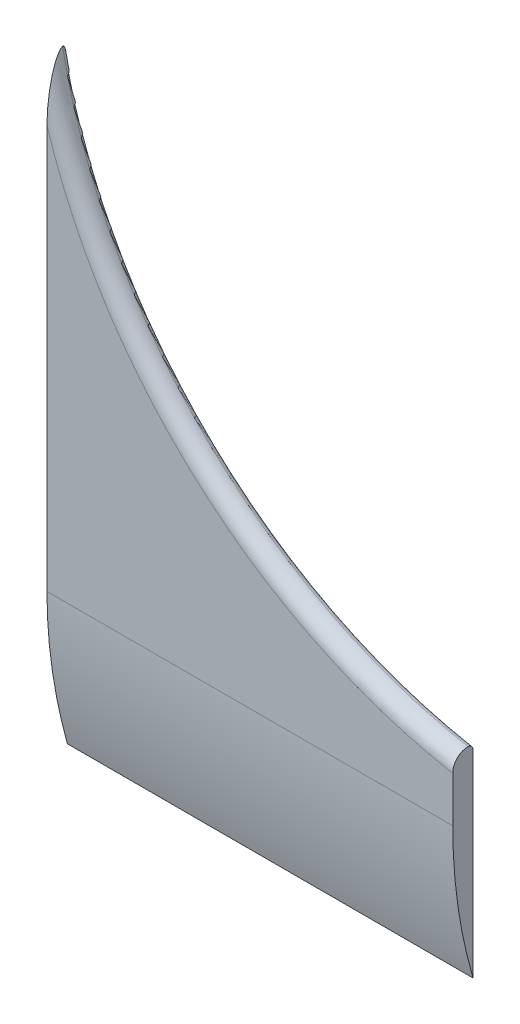
ISO-10303-21;
HEADER;
FILE_DESCRIPTION(('STEP AP214'),'2;1');
FILE_NAME('part.step','',(''),(''),'','','');
FILE_SCHEMA(('AUTOMOTIVE_DESIGN { 1 0 10303 214 1 1 1 1 }'));
ENDSEC;
DATA;
#1=APPLICATION_CONTEXT('core data for automotive mechanical design processes');
#2=APPLICATION_PROTOCOL_DEFINITION('international standard','automotive_design',2000,#1);
#3=PRODUCT_CONTEXT('',#1,'mechanical');
#4=PRODUCT('Part','Part','',(#3));
#5=PRODUCT_RELATED_PRODUCT_CATEGORY('part','',(#4));
#6=PRODUCT_DEFINITION_FORMATION('','',#4);
#7=PRODUCT_DEFINITION_CONTEXT('part definition',#1,'design');
#8=PRODUCT_DEFINITION('design','',#6,#7);
#9=PRODUCT_DEFINITION_SHAPE('','',#8);
#10=(LENGTH_UNIT() NAMED_UNIT(*) SI_UNIT(.MILLI.,.METRE.));
#11=(NAMED_UNIT(*) PLANE_ANGLE_UNIT() SI_UNIT($,.RADIAN.));
#12=(NAMED_UNIT(*) SI_UNIT($,.STERADIAN.) SOLID_ANGLE_UNIT());
#13=UNCERTAINTY_MEASURE_WITH_UNIT(LENGTH_MEASURE(1.E-05),#10,'distance_accuracy_value','');
#14=(GEOMETRIC_REPRESENTATION_CONTEXT(3) GLOBAL_UNCERTAINTY_ASSIGNED_CONTEXT((#13)) GLOBAL_UNIT_ASSIGNED_CONTEXT((#10,
#11,#12)) REPRESENTATION_CONTEXT('',''));
#15=CARTESIAN_POINT('',(0.,0.,0.));
#16=DIRECTION('',(0.,0.,1.));
#17=DIRECTION('',(1.,0.,0.));
#18=AXIS2_PLACEMENT_3D('',#15,#16,#17);
#19=CARTESIAN_POINT('',(40.,-30.,1.));
#20=DIRECTION('',(-1.,0.,0.));
#21=DIRECTION('',(0.,0.,1.));
#22=AXIS2_PLACEMENT_3D('',#19,#20,#21);
#23=PLANE('',#22);
#24=DIRECTION('',(0.,1.,0.));
#25=VECTOR('',#24,1.);
#26=CARTESIAN_POINT('',(40.,-30.,1.));
#27=LINE('',#26,#25);
#28=CARTESIAN_POINT('',(40.,-16.,1.));
#29=VERTEX_POINT('',#28);
#30=CARTESIAN_POINT('',(40.,-11.525023269675,1.));
#31=VERTEX_POINT('',#30);
#32=EDGE_CURVE('E108',#29,#31,#27,.T.);
#33=ORIENTED_EDGE('',*,*,#32,.F.);
#34=CARTESIAN_POINT('',(40.,-16.,-49.));
#35=DIRECTION('',(-1.,0.,0.));
#36=DIRECTION('',(0.,0.,1.));
#37=AXIS2_PLACEMENT_3D('',#34,#35,#36);
#38=CIRCLE('',#37,50.);
#39=CARTESIAN_POINT('',(40.,-30.,-1.));
#40=VERTEX_POINT('',#39);
#41=EDGE_CURVE('E56',#29,#40,#38,.F.);
#42=ORIENTED_EDGE('',*,*,#41,.T.);
#43=DIRECTION('',(0.,1.,0.));
#44=VECTOR('',#43,1.);
#45=CARTESIAN_POINT('',(40.,-30.,-1.));
#46=LINE('',#45,#44);
#47=CARTESIAN_POINT('',(40.,-10.5085104439843,-1.));
#48=VERTEX_POINT('',#47);
#49=EDGE_CURVE('E109',#40,#48,#46,.T.);
#50=ORIENTED_EDGE('',*,*,#49,.T.);
#51=CARTESIAN_POINT('',(40.,-10.5085104439843,-1.));
#52=CARTESIAN_POINT('',(40.,-10.4795471118296,-1.00002221264055));
#53=CARTESIAN_POINT('',(40.,-10.4505882754862,-0.997567320803171));
#54=CARTESIAN_POINT('',(40.,-10.3934931612211,-0.987864810247076));
#55=CARTESIAN_POINT('',(40.,-10.3653566412935,-0.980618616734931));
#56=CARTESIAN_POINT('',(40.,-10.3106840790111,-0.961488695517916));
#57=CARTESIAN_POINT('',(40.,-10.2841490711621,-0.949602006505457));
#58=CARTESIAN_POINT('',(40.,-10.2334790806989,-0.921513841692551));
#59=CARTESIAN_POINT('',(40.,-10.2093433557041,-0.905313706291577));
#60=CARTESIAN_POINT('',(40.,-10.1643591795701,-0.869171944926521));
#61=CARTESIAN_POINT('',(40.,-10.1434870866289,-0.849259761850499));
#62=CARTESIAN_POINT('',(40.,-10.1054437793418,-0.806157591512101));
#63=CARTESIAN_POINT('',(40.,-10.088273148239,-0.782967088633384));
#64=CARTESIAN_POINT('',(40.,-10.0584193230411,-0.734366834916657));
#65=CARTESIAN_POINT('',(40.,-10.0456694067947,-0.708998017663969));
#66=CARTESIAN_POINT('',(40.,-10.0246931559389,-0.656464460146384));
#67=CARTESIAN_POINT('',(40.,-10.016463059806,-0.629301234397732));
#68=CARTESIAN_POINT('',(40.,-10.0070913179838,-0.584941540157593));
#69=CARTESIAN_POINT('',(40.,-10.0044336041097,-0.568050899541574));
#70=CARTESIAN_POINT('',(40.,-10.0008884178412,-0.534109481418608));
#71=CARTESIAN_POINT('',(40.,-9.99999840453974,-0.517058969209915));
#72=CARTESIAN_POINT('',(40.,-9.99999999999902,-0.500000000000208));
#73=B_SPLINE_CURVE_WITH_KNOTS('',3,(#51,#52,#53,#54,#55,#56,#57,#58,#59,#60,#61,#62,#63,#64,#65,
#66,#67,#68,#69,#70,#71,#72),.UNSPECIFIED.,.F.,.F.,(4,2,2,2,2,2,2,2,2,2,4),(0.,
0.0867802611777171,0.173534720558421,0.26034463257154,0.347127599904836,0.433249453384843,
0.519384867269449,0.604157002318121,0.688858480247292,0.740069336086513,0.791206527603931),.UNSPECIFIED.);
#74=CARTESIAN_POINT('',(40.,-10.,-0.5));
#75=VERTEX_POINT('',#74);
#76=EDGE_CURVE('E111',#48,#75,#73,.T.);
#77=ORIENTED_EDGE('',*,*,#76,.T.);
#78=CARTESIAN_POINT('',(40.,-10.,-0.5));
#79=CARTESIAN_POINT('',(40.,-9.99999989012411,-0.458310910647502));
#80=CARTESIAN_POINT('',(40.,-10.0017690069438,-0.416641982005305));
#81=CARTESIAN_POINT('',(40.,-10.0088241022484,-0.333606404976778));
#82=CARTESIAN_POINT('',(40.,-10.0141097896887,-0.29223973186107));
#83=CARTESIAN_POINT('',(40.,-10.0351798469738,-0.1691503860436));
#84=CARTESIAN_POINT('',(40.,-10.0561774253668,-0.0882588576881697));
#85=CARTESIAN_POINT('',(40.,-10.1114326494251,0.0688379045900222));
#86=CARTESIAN_POINT('',(40.,-10.1456944090945,0.14504167605668));
#87=CARTESIAN_POINT('',(40.,-10.2264313436635,0.29068002040499));
#88=CARTESIAN_POINT('',(40.,-10.2729060571775,0.360114848870493));
#89=CARTESIAN_POINT('',(40.,-10.3770788360443,0.490830210576606));
#90=CARTESIAN_POINT('',(40.,-10.4348584708774,0.552045673429615));
#91=CARTESIAN_POINT('',(40.,-10.5597421412859,0.664103914660427));
#92=CARTESIAN_POINT('',(40.,-10.626848275126,0.714944352506364));
#93=CARTESIAN_POINT('',(40.,-10.7696163390778,0.805662485032933));
#94=CARTESIAN_POINT('',(40.,-10.845398430101,0.845350880953757));
#95=CARTESIAN_POINT('',(40.,-11.0024735135336,0.911635714338112));
#96=CARTESIAN_POINT('',(40.,-11.0837644862225,0.938236920726725));
#97=CARTESIAN_POINT('',(40.,-11.2253380884245,0.971929604679482));
#98=CARTESIAN_POINT('',(40.,-11.2848292202642,0.98244900637073));
#99=CARTESIAN_POINT('',(40.,-11.404547480364,0.996484026174966));
#100=CARTESIAN_POINT('',(40.,-11.4647734631565,1.0000094171417));
#101=CARTESIAN_POINT('',(40.,-11.525023269675,1.));
#102=B_SPLINE_CURVE_WITH_KNOTS('',3,(#78,#79,#80,#81,#82,#83,#84,#85,#86,#87,#88,#89,#90,#91,
#92,#93,#94,#95,#96,#97,#98,#99,#100,#101),.UNSPECIFIED.,.F.,.F.,(4,2,2,2,2,2,2,2,2,2,2,4),(0.,
0.12498980418253,0.249969265028521,0.499396510582564,0.748901180278982,0.998396425448825,
1.24976308747336,1.50118639349452,1.75665003598389,2.0120205193579,2.19287360343205,
2.37347379983082),.UNSPECIFIED.);
#103=EDGE_CURVE('E133',#75,#31,#102,.T.);
#104=ORIENTED_EDGE('',*,*,#103,.T.);
#105=EDGE_LOOP('',(#33,#42,#50,#77,#104));
#106=FACE_BOUND('',#105,.T.);
#107=ADVANCED_FACE('F43',(#106),#23,.F.);
#108=CARTESIAN_POINT('',(49.1547594742265,39.1547594742265,1.));
#109=DIRECTION('',(0.,0.,1.));
#110=DIRECTION('',(1.,0.,0.));
#111=AXIS2_PLACEMENT_3D('',#108,#109,#110);
#112=PLANE('',#111);
#113=DIRECTION('',(0.,-1.,0.));
#114=VECTOR('',#113,1.);
#115=CARTESIAN_POINT('',(0.,0.,1.));
#116=LINE('',#115,#114);
#117=CARTESIAN_POINT('',(0.,23.7905276017592,1.));
#118=VERTEX_POINT('',#117);
#119=CARTESIAN_POINT('',(0.,-16.,1.));
#120=VERTEX_POINT('',#119);
#121=EDGE_CURVE('E97',#118,#120,#116,.T.);
#122=ORIENTED_EDGE('',*,*,#121,.T.);
#123=DIRECTION('',(-1.,0.,0.));
#124=VECTOR('',#123,1.);
#125=CARTESIAN_POINT('',(40.,-16.,1.));
#126=LINE('',#125,#124);
#127=EDGE_CURVE('E104',#120,#29,#126,.F.);
#128=ORIENTED_EDGE('',*,*,#127,.T.);
#129=ORIENTED_EDGE('',*,*,#32,.T.);
#130=CARTESIAN_POINT('',(49.1547594742265,39.1547594742265,1.));
#131=DIRECTION('',(0.,0.,1.));
#132=DIRECTION('',(1.,0.,0.));
#133=AXIS2_PLACEMENT_3D('',#130,#131,#132);
#134=CIRCLE('',#133,51.5);
#135=EDGE_CURVE('E107',#31,#118,#134,.F.);
#136=ORIENTED_EDGE('',*,*,#135,.T.);
#137=EDGE_LOOP('',(#122,#128,#129,#136));
#138=FACE_BOUND('',#137,.T.);
#139=ADVANCED_FACE('F103',(#138),#112,.T.);
#140=CARTESIAN_POINT('',(49.1547594742265,39.1547594742265,-1.));
#141=DIRECTION('',(0.,0.,1.));
#142=DIRECTION('',(1.,0.,0.));
#143=AXIS2_PLACEMENT_3D('',#140,#141,#142);
#144=PLANE('',#143);
#145=DIRECTION('',(0.,-1.,0.));
#146=VECTOR('',#145,1.);
#147=CARTESIAN_POINT('',(0.,0.,-1.));
#148=LINE('',#147,#146);
#149=CARTESIAN_POINT('',(0.,27.576347621518,-1.));
#150=VERTEX_POINT('',#149);
#151=CARTESIAN_POINT('',(0.,-30.,-1.));
#152=VERTEX_POINT('',#151);
#153=EDGE_CURVE('E99',#150,#152,#148,.T.);
#154=ORIENTED_EDGE('',*,*,#153,.F.);
#155=CARTESIAN_POINT('',(49.1547594742265,39.1547594742265,-1.));
#156=DIRECTION('',(0.,0.,1.));
#157=DIRECTION('',(1.,0.,0.));
#158=AXIS2_PLACEMENT_3D('',#155,#156,#157);
#159=CIRCLE('',#158,50.5);
#160=EDGE_CURVE('E70',#150,#48,#159,.T.);
#161=ORIENTED_EDGE('',*,*,#160,.T.);
#162=ORIENTED_EDGE('',*,*,#49,.F.);
#163=DIRECTION('',(1.,0.,0.));
#164=VECTOR('',#163,1.);
#165=CARTESIAN_POINT('',(0.,-30.,-1.));
#166=LINE('',#165,#164);
#167=EDGE_CURVE('E143',#152,#40,#166,.T.);
#168=ORIENTED_EDGE('',*,*,#167,.F.);
#169=EDGE_LOOP('',(#154,#161,#162,#168));
#170=FACE_BOUND('',#169,.T.);
#171=ADVANCED_FACE('F128',(#170),#144,.F.);
#172=CARTESIAN_POINT('',(49.1547594742265,39.1547594742265,-0.5));
#173=DIRECTION('',(0.,0.,1.));
#174=DIRECTION('',(1.,0.,0.));
#175=AXIS2_PLACEMENT_3D('',#172,#173,#174);
#176=TOROIDAL_SURFACE('',#175,51.5,1.5);
#177=CARTESIAN_POINT('',(0.017990406996677,19.3723488315098,-0.801044172473317));
#178=CARTESIAN_POINT('',(0.0201890210205972,19.3518732019691,-0.773692358620135));
#179=CARTESIAN_POINT('',(0.0223792775670738,19.3328778936785,-0.745020922448024));
#180=CARTESIAN_POINT('',(0.0266823967686508,19.2989926408342,-0.685001106760244));
#181=CARTESIAN_POINT('',(0.0287943117257762,19.2841439654705,-0.653629620025882));
#182=CARTESIAN_POINT('',(0.0325311046193656,19.2619447971403,-0.593584510019055));
#183=CARTESIAN_POINT('',(0.0341814862719751,19.2538029741086,-0.565213608501333));
#184=CARTESIAN_POINT('',(0.0372760641839536,19.2424523600466,-0.507595439493937));
#185=CARTESIAN_POINT('',(0.0387211333625778,19.2392220807779,-0.47835256350332));
#186=CARTESIAN_POINT('',(0.0413608576301072,19.2380254930203,-0.419625099429942));
#187=CARTESIAN_POINT('',(0.0425545040747453,19.2400799662378,-0.390140012974413));
#188=CARTESIAN_POINT('',(0.0446575849355582,19.2492989336148,-0.331938062588085));
#189=CARTESIAN_POINT('',(0.0455664812588236,19.2564730194961,-0.303222745774203));
#190=CARTESIAN_POINT('',(0.0472905879379253,19.277490095731,-0.240613521425196));
#191=CARTESIAN_POINT('',(0.0480316376553601,19.2925162582786,-0.207119794316093));
#192=CARTESIAN_POINT('',(0.0491551960677224,19.3277136078244,-0.142976752530948));
#193=CARTESIAN_POINT('',(0.0495370694893166,19.3478938309533,-0.112332563730914));
#194=CARTESIAN_POINT('',(0.050181169024065,19.4062043891758,-0.0349352116313078));
#195=CARTESIAN_POINT('',(0.0502059778865656,19.4474988306486,0.00940677811335384));
#196=CARTESIAN_POINT('',(0.0497894707158123,19.5359357167304,0.0917479943867213));
#197=CARTESIAN_POINT('',(0.0493467786088654,19.5830950630713,0.129728112697079));
#198=CARTESIAN_POINT('',(0.0479866192530714,19.6968128249044,0.212090447634693));
#199=CARTESIAN_POINT('',(0.0469620458030121,19.7647205934824,0.254583921059492));
#200=CARTESIAN_POINT('',(0.0446548341515669,19.9042566912021,0.333038844629393));
#201=CARTESIAN_POINT('',(0.0433716986276272,19.9758919899055,0.368987448672048));
#202=CARTESIAN_POINT('',(0.0406762663358588,20.1218484686142,0.435915757261977));
#203=CARTESIAN_POINT('',(0.039263361017678,20.1961811993873,0.466869955558987));
#204=CARTESIAN_POINT('',(0.0363988543183283,20.3463634892609,0.524571968888383));
#205=CARTESIAN_POINT('',(0.0349472873485611,20.4222116854011,0.551323387382656));
#206=CARTESIAN_POINT('',(0.0312771826923507,20.6163702649632,0.614912227354919));
#207=CARTESIAN_POINT('',(0.029068517823946,20.7354554404681,0.649377532449211));
#208=CARTESIAN_POINT('',(0.0248048147947278,20.9753294132509,0.711859436716994));
#209=CARTESIAN_POINT('',(0.0227498522202477,21.0961190144591,0.739872876947634));
#210=CARTESIAN_POINT('',(0.0188572750381736,21.3390206898577,0.79059309534918));
#211=CARTESIAN_POINT('',(0.0170200458293505,21.4611347034311,0.81329053124272));
#212=CARTESIAN_POINT('',(0.0136058339349642,21.706137626248,0.854092879137539));
#213=CARTESIAN_POINT('',(0.012028890963026,21.829026650776,0.872197090545524));
#214=CARTESIAN_POINT('',(0.00772305582729158,22.1986027385869,0.920506936267189));
#215=CARTESIAN_POINT('',(0.00542093689504891,22.4460903711893,0.94468835490887));
#216=CARTESIAN_POINT('',(0.00201382412319227,22.9417018746131,0.979901218347977));
#217=CARTESIAN_POINT('',(0.00090767485700025,23.1898248988072,0.99094535611118));
#218=CARTESIAN_POINT('',(-7.13499441072461E-05,23.6464208130772,1.00071654819759));
#219=CARTESIAN_POINT('',(-0.000113794251979718,23.8548602297423,1.00113722345796));
#220=CARTESIAN_POINT('',(0.000552315685551214,24.2716544119936,0.994494728350912));
#221=CARTESIAN_POINT('',(0.00126101491139938,24.4800091534702,0.987430113225443));
#222=CARTESIAN_POINT('',(0.00334748288730052,24.8959345632528,0.966172421404106));
#223=CARTESIAN_POINT('',(0.00472391869669669,25.1035059668465,0.951993544325087));
#224=CARTESIAN_POINT('',(0.00804399005413374,25.5180163329282,0.916610382166509));
#225=CARTESIAN_POINT('',(0.00998756190793681,25.7249553638013,0.895406885975699));
#226=CARTESIAN_POINT('',(0.0147880426709352,26.182481815837,0.840497799850541));
#227=CARTESIAN_POINT('',(0.0177515103200017,26.432868427986,0.805082945559892));
#228=CARTESIAN_POINT('',(0.0224831681876911,26.8070170256541,0.743305188998795));
#229=CARTESIAN_POINT('',(0.0241082890902726,26.9315057917562,0.721267655377457));
#230=CARTESIAN_POINT('',(0.0274097183053882,27.1798872114429,0.674065670845711));
#231=CARTESIAN_POINT('',(0.0290860244263493,27.3037798902878,0.648901353672092));
#232=CARTESIAN_POINT('',(0.0328330244826292,27.5798899833358,0.588782144992187));
#233=CARTESIAN_POINT('',(0.0349036810491829,27.7319107554242,0.552916918088591));
#234=CARTESIAN_POINT('',(0.0389195173263716,28.0343672777805,0.474907948010176));
#235=CARTESIAN_POINT('',(0.0408646962996604,28.18480301873,0.432764167945399));
#236=CARTESIAN_POINT('',(0.04378896715468,28.4290068569604,0.357142673856988));
#237=CARTESIAN_POINT('',(0.0448624008570281,28.5235185954956,0.326074068399809));
#238=CARTESIAN_POINT('',(0.0468039875198912,28.7110531776099,0.259861990099433));
#239=CARTESIAN_POINT('',(0.047672294868651,28.8040770915176,0.224721611757512));
#240=CARTESIAN_POINT('',(0.0488460997610177,28.9566992294885,0.161892403718618));
#241=CARTESIAN_POINT('',(0.0492425878923735,29.0169212778684,0.13572529675186));
#242=CARTESIAN_POINT('',(0.0498411880162019,29.1361103923384,0.0803717767957806));
#243=CARTESIAN_POINT('',(0.0500429680553036,29.1950751481714,0.0511803010984012));
#244=CARTESIAN_POINT('',(0.050172636218612,29.3150964940404,-0.0133427933031501));
#245=CARTESIAN_POINT('',(0.0500797442643694,29.3759977305432,-0.0489652620555763));
#246=CARTESIAN_POINT('',(0.0494019134964185,29.4936247583052,-0.126486236789947));
#247=CARTESIAN_POINT('',(0.0488187597717216,29.5503648867774,-0.168361521403146));
#248=CARTESIAN_POINT('',(0.0473945697745619,29.6246141142479,-0.234476444117406));
#249=CARTESIAN_POINT('',(0.0469037930713385,29.6456604272482,-0.254707885757142));
#250=CARTESIAN_POINT('',(0.0457290179360025,29.6856361856867,-0.297270236574779));
#251=CARTESIAN_POINT('',(0.0450446631148599,29.7045616359112,-0.319604966961981));
#252=CARTESIAN_POINT('',(0.0434161046249437,29.7394855479511,-0.367039587665138));
#253=CARTESIAN_POINT('',(0.0424680854194472,29.7554347958519,-0.392176557026415));
#254=CARTESIAN_POINT('',(0.040253886356786,29.7822770511771,-0.444999805102793));
#255=CARTESIAN_POINT('',(0.0389892561364588,29.7931939704242,-0.472673262661758));
#256=CARTESIAN_POINT('',(0.0366331741715174,29.8053619830407,-0.519621763692003));
#257=CARTESIAN_POINT('',(0.0356412085252932,29.8086727713579,-0.538365985320766));
#258=CARTESIAN_POINT('',(0.0335333414746627,29.8120292431953,-0.576130563115314));
#259=CARTESIAN_POINT('',(0.0324175816890461,29.8120786199241,-0.595150582545253));
#260=CARTESIAN_POINT('',(0.0300973748896293,29.8088913042832,-0.632867341476952));
#261=CARTESIAN_POINT('',(0.02889307550422,29.8056599717673,-0.651564557684276));
#262=CARTESIAN_POINT('',(0.026431071837085,29.7962450566803,-0.688236167354146));
#263=CARTESIAN_POINT('',(0.0251732268972886,29.7900531975361,-0.706208380281744));
#264=CARTESIAN_POINT('',(0.0229209848602783,29.776882545761,-0.737251315253963));
#265=CARTESIAN_POINT('',(0.0219295666177269,29.7703772625689,-0.750529912009869));
#266=CARTESIAN_POINT('',(0.019953896877257,29.7561916504333,-0.776331246492334));
#267=CARTESIAN_POINT('',(0.0189696420350598,29.7485195208591,-0.788858468201027));
#268=CARTESIAN_POINT('',(0.0179904069966788,29.7403648976845,-0.801044172473273));
#269=B_SPLINE_CURVE_WITH_KNOTS('',3,(#177,#178,#179,#180,#181,#182,#183,#184,#185,#186,#187,
#188,#189,#190,#191,#192,#193,#194,#195,#196,#197,#198,#199,#200,#201,#202,#203,#204,#205,#206,
#207,#208,#209,#210,#211,#212,#213,#214,#215,#216,#217,#218,#219,#220,#221,#222,#223,#224,#225,
#226,#227,#228,#229,#230,#231,#232,#233,#234,#235,#236,#237,#238,#239,#240,#241,#242,#243,#244,
#245,#246,#247,#248,#249,#250,#251,#252,#253,#254,#255,#256,#257,#258,#259,#260,#261,#262,#263,
#264,#265,#266,#267,#268),.UNSPECIFIED.,.F.,.F.,(4,2,2,2,2,2,2,2,2,2,2,2,2,2,2,2,2,2,2,2,2,2,2,
2,2,2,2,2,2,2,2,2,2,2,2,2,2,2,2,2,2,2,2,2,2,4),(0.,0.102922209561116,0.20683493780899,
0.295136902624843,0.383051419102899,0.471312177762052,0.559738730746496,0.6692745429935,
0.779003728377098,0.959754471176885,1.14103873466118,1.3808197230488,1.62106638956318,
1.86250360202711,2.10373266306707,2.475454008559,2.84735697006074,3.21990868549464,
3.59251719121429,4.33806516973589,5.08289222880438,5.70807018898893,6.3333688386068,
6.95742436699771,7.58140983556232,8.33981944811535,8.71909241166976,9.09834915878347,
9.56687030197129,10.0353941980875,10.3338087427513,10.6319979651382,10.8289295124438,
11.0261962137332,11.2376751245937,11.4483873392101,11.5358713503869,11.6235174851147,
11.7125046240375,11.8010644551975,11.8579920543433,11.9148551878141,11.9716255704801,
12.0285555991461,12.072949707255,12.1170451601603),.UNSPECIFIED.);
#270=CARTESIAN_POINT('',(0.0376178066529316,29.8002742180775,-0.499999999999127));
#271=VERTEX_POINT('',#270);
#272=EDGE_CURVE('E146',#118,#271,#269,.T.);
#273=ORIENTED_EDGE('',*,*,#272,.F.);
#274=ORIENTED_EDGE('',*,*,#135,.F.);
#275=ORIENTED_EDGE('',*,*,#103,.F.);
#276=CARTESIAN_POINT('',(49.1547594742265,39.1547594742265,-0.5));
#277=DIRECTION('',(0.,0.,1.));
#278=DIRECTION('',(1.,0.,0.));
#279=AXIS2_PLACEMENT_3D('',#276,#277,#278);
#280=CIRCLE('',#279,50.);
#281=EDGE_CURVE('E139',#271,#75,#280,.T.);
#282=ORIENTED_EDGE('',*,*,#281,.F.);
#283=EDGE_LOOP('',(#273,#274,#275,#282));
#284=FACE_BOUND('',#283,.T.);
#285=ADVANCED_FACE('F130',(#284),#176,.T.);
#286=CARTESIAN_POINT('',(49.1547594742265,39.1547594742265,-0.5));
#287=DIRECTION('',(0.,0.,1.));
#288=DIRECTION('',(1.,0.,0.));
#289=AXIS2_PLACEMENT_3D('',#286,#287,#288);
#290=TOROIDAL_SURFACE('',#289,50.5,0.5);
#291=CARTESIAN_POINT('',(0.0453770950277599,29.5580049950777,-0.308136543672596));
#292=CARTESIAN_POINT('',(0.045198757860582,29.5714162059146,-0.313915006838382));
#293=CARTESIAN_POINT('',(0.0450093352750231,29.5847436834,-0.31990285510491));
#294=CARTESIAN_POINT('',(0.0446003255279736,29.6111938367429,-0.332439576185241));
#295=CARTESIAN_POINT('',(0.0443806243177517,29.6243155188169,-0.33899053315289));
#296=CARTESIAN_POINT('',(0.0438919415707149,29.6508851651342,-0.353110839141263));
#297=CARTESIAN_POINT('',(0.0436209906179522,29.6643145792057,-0.360715442375553));
#298=CARTESIAN_POINT('',(0.0430251378076047,29.6905773091371,-0.376861724855844));
#299=CARTESIAN_POINT('',(0.0427003309538173,29.7034116246399,-0.385401745143881));
#300=CARTESIAN_POINT('',(0.0419802717203205,29.7280060024566,-0.403638025998714));
#301=CARTESIAN_POINT('',(0.041585897023586,29.7397769657512,-0.413319432963658));
#302=CARTESIAN_POINT('',(0.0406957618898348,29.7616169093502,-0.434301389513328));
#303=CARTESIAN_POINT('',(0.0402013621944743,29.7717057262487,-0.445579654835706));
#304=CARTESIAN_POINT('',(0.0393892301382069,29.7839270332549,-0.463293502579613));
#305=CARTESIAN_POINT('',(0.0391303995365055,29.7873261541827,-0.468846397232819));
#306=CARTESIAN_POINT('',(0.0385825963985847,29.7933298455641,-0.480375654997578));
#307=CARTESIAN_POINT('',(0.038293622352893,29.7959343762019,-0.486352039311117));
#308=CARTESIAN_POINT('',(0.0376827129018707,29.8001314034163,-0.498740664004856));
#309=CARTESIAN_POINT('',(0.0373604220845758,29.8017113190524,-0.505157290767459));
#310=CARTESIAN_POINT('',(0.0366935316519879,29.8035873254423,-0.518173480381845));
#311=CARTESIAN_POINT('',(0.0363489648854589,29.8038852646993,-0.524772766016514));
#312=CARTESIAN_POINT('',(0.0356917455895001,29.8031921990633,-0.537124879286454));
#313=CARTESIAN_POINT('',(0.0353800607560878,29.8023475430412,-0.5428866211971));
#314=CARTESIAN_POINT('',(0.0347590794878132,29.799715603882,-0.554190388632589));
#315=CARTESIAN_POINT('',(0.0344497857014135,29.7979273951188,-0.559732192648047));
#316=CARTESIAN_POINT('',(0.0337198300873809,29.7927088799618,-0.572628643772737));
#317=CARTESIAN_POINT('',(0.0333035724362805,29.7889087163878,-0.579832061731898));
#318=CARTESIAN_POINT('',(0.0324966357931523,29.780240053657,-0.593562633824448));
#319=CARTESIAN_POINT('',(0.0321060268750929,29.7753687739745,-0.600087961542021));
#320=CARTESIAN_POINT('',(0.031028307291341,29.7604438384837,-0.617831801115321));
#321=CARTESIAN_POINT('',(0.0303725614177007,29.7495145966686,-0.62830448947257));
#322=CARTESIAN_POINT('',(0.029131861739377,29.7263784985852,-0.647710039208257));
#323=CARTESIAN_POINT('',(0.0285471464172816,29.7141675816931,-0.656637753782547));
#324=CARTESIAN_POINT('',(0.0270555401713048,29.6805253479182,-0.67902051891289));
#325=CARTESIAN_POINT('',(0.0261973128893771,29.6584295269498,-0.691468321260484));
#326=CARTESIAN_POINT('',(0.0245815848749305,29.6132191739575,-0.714393291906678));
#327=CARTESIAN_POINT('',(0.0238243467719916,29.5901021862068,-0.724865350348392));
#328=CARTESIAN_POINT('',(0.0223815744323368,29.5431541576988,-0.744451692059881));
#329=CARTESIAN_POINT('',(0.0216964517258429,29.5193199220983,-0.753558296583493));
#330=CARTESIAN_POINT('',(0.020387163131368,29.471305038017,-0.770686515842333));
#331=CARTESIAN_POINT('',(0.0197629194903482,29.447124877856,-0.778709519702449));
#332=CARTESIAN_POINT('',(0.0178031261114553,29.3677183142373,-0.803560235075192));
#333=CARTESIAN_POINT('',(0.0165679083919984,29.311953904067,-0.818671349508412));
#334=CARTESIAN_POINT('',(0.0142775040174764,29.1997263320598,-0.846085881914929));
#335=CARTESIAN_POINT('',(0.0132224417981293,29.1432627159129,-0.858387361201193));
#336=CARTESIAN_POINT('',(0.0112582766795978,29.029787391855,-0.880888465943623));
#337=CARTESIAN_POINT('',(0.0103495044005211,28.9727747427151,-0.891083344750723));
#338=CARTESIAN_POINT('',(0.00866158444231688,28.85846411667,-0.909751683890864));
#339=CARTESIAN_POINT('',(0.007882453645075,28.8011661036037,-0.918224920063692));
#340=CARTESIAN_POINT('',(0.00572178663580306,28.6289937949697,-0.941462845461128));
#341=CARTESIAN_POINT('',(0.00451664155775369,28.5138212923474,-0.954049477489964));
#342=CARTESIAN_POINT('',(0.00253327214575766,28.2832220888156,-0.97451664503094));
#343=CARTESIAN_POINT('',(0.00175450453603676,28.1677959004142,-0.982403170400428));
#344=CARTESIAN_POINT('',(0.000610784924985685,27.9368775831105,-0.99392096113107));
#345=CARTESIAN_POINT('',(0.000245305695861183,27.8213857266914,-0.997557648166352));
#346=CARTESIAN_POINT('',(-6.88990842819854E-05,27.5902947892979,-1.00068635800719));
#347=CARTESIAN_POINT('',(-1.74405933308231E-05,27.4746956834961,-1.00017655049337));
#348=CARTESIAN_POINT('',(0.000519975125807166,27.2438279197943,-0.994816963470269));
#349=CARTESIAN_POINT('',(0.00100504977040029,27.1285590675659,-0.989975999592087));
#350=CARTESIAN_POINT('',(0.00243993736783401,26.8983654654847,-0.975444923627007));
#351=CARTESIAN_POINT('',(0.00338959139225161,26.7834406114706,-0.965756469797015));
#352=CARTESIAN_POINT('',(0.00581609477571328,26.5530886303115,-0.940426575915915));
#353=CARTESIAN_POINT('',(0.00729793676009335,26.4376673368425,-0.92472866400162));
#354=CARTESIAN_POINT('',(0.00998847548149581,26.26553794402,-0.895111801844585));
#355=CARTESIAN_POINT('',(0.0109637952619336,26.2083046086849,-0.884221964963178));
#356=CARTESIAN_POINT('',(0.0130919357225178,26.0943816141485,-0.859915447937838));
#357=CARTESIAN_POINT('',(0.0142447059485061,26.0376918052592,-0.846499485801185));
#358=CARTESIAN_POINT('',(0.0166676579829161,25.9293732735077,-0.817456443532671));
#359=CARTESIAN_POINT('',(0.0179228068810334,25.8776808327187,-0.802066916464355));
#360=CARTESIAN_POINT('',(0.0206548880259423,25.7757202364614,-0.76737209809092));
#361=CARTESIAN_POINT('',(0.0221311276649952,25.7254481961002,-0.74807897153531));
#362=CARTESIAN_POINT('',(0.0244307629681132,25.6566817248135,-0.716462026637264));
#363=CARTESIAN_POINT('',(0.0251237049829415,25.636982556909,-0.706767667709233));
#364=CARTESIAN_POINT('',(0.0265731806408769,25.5983333245388,-0.686005594566582));
#365=CARTESIAN_POINT('',(0.0273296449904451,25.5793824761209,-0.674939370734467));
#366=CARTESIAN_POINT('',(0.0289324164994078,25.5424006331982,-0.650818095994432));
#367=CARTESIAN_POINT('',(0.0297798397837599,25.5243863706062,-0.637737209210404));
#368=CARTESIAN_POINT('',(0.0315756965429349,25.4905737636379,-0.608984879946191));
#369=CARTESIAN_POINT('',(0.0325234156398562,25.4747613888476,-0.593331370776094));
#370=CARTESIAN_POINT('',(0.03392620468829,25.4558329856756,-0.569010169863404));
#371=CARTESIAN_POINT('',(0.0343329621383112,25.4508182433722,-0.561836062398699));
#372=CARTESIAN_POINT('',(0.0351630203395233,25.4417598883023,-0.546886233151399));
#373=CARTESIAN_POINT('',(0.0355863218079144,25.4377163176916,-0.539110485272724));
#374=CARTESIAN_POINT('',(0.036448624107023,25.4308805994373,-0.522895315742291));
#375=CARTESIAN_POINT('',(0.0368877558394556,25.4281049409065,-0.514448738928631));
#376=CARTESIAN_POINT('',(0.0377622903412389,25.4242339287039,-0.497180169052539));
#377=CARTESIAN_POINT('',(0.0381976987035869,25.4231353161742,-0.488358938413324));
#378=CARTESIAN_POINT('',(0.0390015872382954,25.4228082172126,-0.471614143294396));
#379=CARTESIAN_POINT('',(0.0393722823915806,25.4233946774433,-0.46369404746067));
#380=CARTESIAN_POINT('',(0.0400842805905182,25.425978770817,-0.44809286642429));
#381=CARTESIAN_POINT('',(0.0404255821366811,25.4279764759057,-0.440411793427931));
#382=CARTESIAN_POINT('',(0.0411477270534538,25.4337706762144,-0.423748002019019));
#383=CARTESIAN_POINT('',(0.0415195096946664,25.4378759640523,-0.414874144213157));
#384=CARTESIAN_POINT('',(0.0422122460650746,25.447467029817,-0.397841793726185));
#385=CARTESIAN_POINT('',(0.0425327891872361,25.4529631284326,-0.389689293032224));
#386=CARTESIAN_POINT('',(0.0433938422267677,25.4702342947347,-0.367167369862703));
#387=CARTESIAN_POINT('',(0.0438746333499734,25.4832282769052,-0.35376004059694));
#388=CARTESIAN_POINT('',(0.0447052612762184,25.5107243766272,-0.329408430100528));
#389=CARTESIAN_POINT('',(0.0450584769101184,25.5251721480237,-0.318404233246212));
#390=CARTESIAN_POINT('',(0.045377095027759,25.5398483484615,-0.30813654367262));
#391=B_SPLINE_CURVE_WITH_KNOTS('',3,(#291,#292,#293,#294,#295,#296,#297,#298,#299,#300,#301,
#302,#303,#304,#305,#306,#307,#308,#309,#310,#311,#312,#313,#314,#315,#316,#317,#318,#319,#320,
#321,#322,#323,#324,#325,#326,#327,#328,#329,#330,#331,#332,#333,#334,#335,#336,#337,#338,#339,
#340,#341,#342,#343,#344,#345,#346,#347,#348,#349,#350,#351,#352,#353,#354,#355,#356,#357,#358,
#359,#360,#361,#362,#363,#364,#365,#366,#367,#368,#369,#370,#371,#372,#373,#374,#375,#376,#377,
#378,#379,#380,#381,#382,#383,#384,#385,#386,#387,#388,#389,#390),.UNSPECIFIED.,.F.,.F.,(4,2,2,
2,2,2,2,2,2,2,2,2,2,2,2,2,2,2,2,2,2,2,2,2,2,2,2,2,2,2,2,2,2,2,2,2,2,2,2,2,2,2,2,2,2,2,2,2,2,4),
(0.,0.0438200677796113,0.0878099464120098,0.134088815410807,0.180286898769906,0.225939135260188,
0.271007682528357,0.290507337682685,0.310007969776886,0.329743725020242,0.349451013391434,
0.366858676308327,0.384283447994588,0.408608912678056,0.432998285774424,0.478196423342625,
0.523542347200638,0.599469694123041,0.675590797554527,0.752125096803053,0.828560332076385,
1.00179204944118,1.17514294037394,1.34888027044708,1.52264020688194,1.87009930119678,
2.21711463839768,2.56368679048209,2.91041193255094,3.25643295211199,3.60233568368381,
3.95157204297507,4.12633792132967,4.30105420029543,4.46282214241553,4.62409352518416,
4.68995584279971,4.75574722508861,4.82246601045179,4.88873803599527,4.91496860340773,
4.94120030920632,4.96776406988417,4.99427614550454,5.01799147441029,5.04170801241739,
5.07089959606049,5.10031449955768,5.15604127089274,5.21015980005124),.UNSPECIFIED.);
#392=EDGE_CURVE('E152',#271,#150,#391,.T.);
#393=ORIENTED_EDGE('',*,*,#392,.F.);
#394=ORIENTED_EDGE('',*,*,#281,.T.);
#395=ORIENTED_EDGE('',*,*,#76,.F.);
#396=ORIENTED_EDGE('',*,*,#160,.F.);
#397=EDGE_LOOP('',(#393,#394,#395,#396));
#398=FACE_BOUND('',#397,.T.);
#399=ADVANCED_FACE('F121',(#398),#290,.T.);
#400=CARTESIAN_POINT('',(0.,-16.,-49.));
#401=DIRECTION('',(1.,0.,0.));
#402=DIRECTION('',(0.,1.,0.));
#403=AXIS2_PLACEMENT_3D('',#400,#401,#402);
#404=CYLINDRICAL_SURFACE('',#403,50.);
#405=CARTESIAN_POINT('',(0.,-30.,-1.00000000000001));
#406=CARTESIAN_POINT('',(0.00833428272081737,-29.7155569893767,-0.917037234516328));
#407=CARTESIAN_POINT('',(0.0153751134047901,-29.4303508501449,-0.836595874144627));
#408=CARTESIAN_POINT('',(0.0272318422816842,-28.8585154813613,-0.680786484104595));
#409=CARTESIAN_POINT('',(0.0320477828352593,-28.5718862790089,-0.605418357868088));
#410=CARTESIAN_POINT('',(0.0437006218214516,-27.7100747107734,-0.386983309179772));
#411=CARTESIAN_POINT('',(0.0477444495181084,-27.132896869684,-0.251564858366465));
#412=CARTESIAN_POINT('',(0.0508997371857687,-25.9770270958421,-0.00197168238011473));
#413=CARTESIAN_POINT('',(0.0500360070165864,-25.3983575355325,0.112306888507358));
#414=CARTESIAN_POINT('',(0.0455355143207395,-24.2373339447924,0.320321777045313));
#415=CARTESIAN_POINT('',(0.0418986891546559,-23.6549798314288,0.414057630609769));
#416=CARTESIAN_POINT('',(0.0335903919873684,-22.4873328691028,0.580866438659496));
#417=CARTESIAN_POINT('',(0.0289189281682276,-21.9020400434158,0.653939556538082));
#418=CARTESIAN_POINT('',(0.0199094158990998,-20.7292425150374,0.779333703282782));
#419=CARTESIAN_POINT('',(0.0155713639739422,-20.1417378354672,0.831654948470469));
#420=CARTESIAN_POINT('',(0.00820303427430149,-18.9622420178363,0.915693281620086));
#421=CARTESIAN_POINT('',(0.00517949295587375,-18.3702432292398,0.94730464708576));
#422=CARTESIAN_POINT('',(0.00210083874083982,-17.4816986613749,0.978919811222482));
#423=CARTESIAN_POINT('',(0.00131739530624279,-17.1854171462489,0.986824552010143));
#424=CARTESIAN_POINT('',(0.00026530658138133,-16.592759259834,0.997364641426066));
#425=CARTESIAN_POINT('',(-3.33829742840003E-06,-16.2963828884695,0.999999985842745));
#426=CARTESIAN_POINT('',(0.,-16.,1.));
#427=B_SPLINE_CURVE_WITH_KNOTS('',3,(#405,#406,#407,#408,#409,#410,#411,#412,#413,#414,#415,
#416,#417,#418,#419,#420,#421,#422,#423,#424,#425,#426),.UNSPECIFIED.,.F.,.F.,(4,2,2,2,2,2,2,2,
2,2,4),(0.,0.889203807410887,1.77839068418481,3.55654102974896,5.32571006914936,
7.09491907220196,8.86411408460907,10.6332906540971,12.4114297921158,13.3005529002104,
14.1896767189398),.UNSPECIFIED.);
#428=EDGE_CURVE('E11',#152,#120,#427,.T.);
#429=ORIENTED_EDGE('',*,*,#428,.F.);
#430=ORIENTED_EDGE('',*,*,#167,.T.);
#431=ORIENTED_EDGE('',*,*,#41,.F.);
#432=ORIENTED_EDGE('',*,*,#127,.F.);
#433=EDGE_LOOP('',(#429,#430,#431,#432));
#434=FACE_BOUND('',#433,.T.);
#435=ADVANCED_FACE('F45',(#434),#404,.T.);
#436=CARTESIAN_POINT('',(-9.9498743710662,-30.,0.));
#437=DIRECTION('',(0.,1.,0.));
#438=DIRECTION('',(0.,0.,1.));
#439=AXIS2_PLACEMENT_3D('',#436,#437,#438);
#440=CYLINDRICAL_SURFACE('',#439,10.);
#441=ORIENTED_EDGE('',*,*,#272,.T.);
#442=ORIENTED_EDGE('',*,*,#392,.T.);
#443=ORIENTED_EDGE('',*,*,#153,.T.);
#444=ORIENTED_EDGE('',*,*,#428,.T.);
#445=ORIENTED_EDGE('',*,*,#121,.F.);
#446=EDGE_LOOP('',(#441,#442,#443,#444,#445));
#447=FACE_BOUND('',#446,.T.);
#448=ADVANCED_FACE('F96',(#447),#440,.F.);
#449=CLOSED_SHELL('',(#107,#139,#171,#285,#399,#435,#448));
#450=MANIFOLD_SOLID_BREP('B2',#449);
#451=ADVANCED_BREP_SHAPE_REPRESENTATION('',(#18,#450),#14);
#452=SHAPE_DEFINITION_REPRESENTATION(#9,#451);
ENDSEC;
END-ISO-10303-21;
